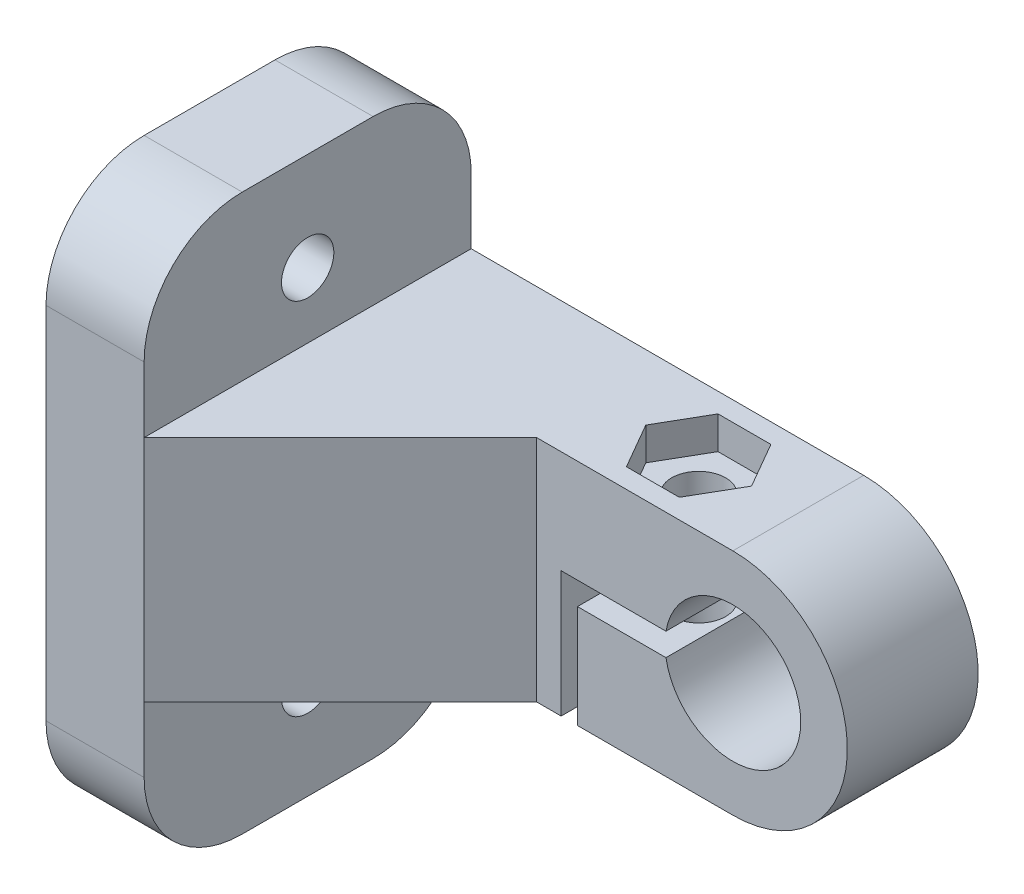
ISO-10303-21;
HEADER;
FILE_DESCRIPTION(('STEP AP214'),'2;1');
FILE_NAME('part.step','',(''),(''),'','','');
FILE_SCHEMA(('AUTOMOTIVE_DESIGN { 1 0 10303 214 1 1 1 1 }'));
ENDSEC;
DATA;
#1=APPLICATION_CONTEXT('core data for automotive mechanical design processes');
#2=APPLICATION_PROTOCOL_DEFINITION('international standard','automotive_design',2000,#1);
#3=PRODUCT_CONTEXT('',#1,'mechanical');
#4=PRODUCT('Part','Part','',(#3));
#5=PRODUCT_RELATED_PRODUCT_CATEGORY('part','',(#4));
#6=PRODUCT_DEFINITION_FORMATION('','',#4);
#7=PRODUCT_DEFINITION_CONTEXT('part definition',#1,'design');
#8=PRODUCT_DEFINITION('design','',#6,#7);
#9=PRODUCT_DEFINITION_SHAPE('','',#8);
#10=(LENGTH_UNIT() NAMED_UNIT(*) SI_UNIT(.MILLI.,.METRE.));
#11=(NAMED_UNIT(*) PLANE_ANGLE_UNIT() SI_UNIT($,.RADIAN.));
#12=(NAMED_UNIT(*) SI_UNIT($,.STERADIAN.) SOLID_ANGLE_UNIT());
#13=UNCERTAINTY_MEASURE_WITH_UNIT(LENGTH_MEASURE(1.E-05),#10,'distance_accuracy_value','');
#14=(GEOMETRIC_REPRESENTATION_CONTEXT(3) GLOBAL_UNCERTAINTY_ASSIGNED_CONTEXT((#13)) GLOBAL_UNIT_ASSIGNED_CONTEXT((#10,
#11,#12)) REPRESENTATION_CONTEXT('',''));
#15=CARTESIAN_POINT('',(0.,0.,0.));
#16=DIRECTION('',(0.,0.,1.));
#17=DIRECTION('',(1.,0.,0.));
#18=AXIS2_PLACEMENT_3D('',#15,#16,#17);
#19=CARTESIAN_POINT('',(-6.09053786194432,17.,4.));
#20=DIRECTION('',(0.,-1.,0.));
#21=DIRECTION('',(1.,0.,0.));
#22=AXIS2_PLACEMENT_3D('',#19,#20,#21);
#23=CYLINDRICAL_SURFACE('',#22,1.65);
#24=CARTESIAN_POINT('',(-6.09053786194432,0.699999999999999,4.));
#25=DIRECTION('',(0.,1.,0.));
#26=DIRECTION('',(-1.,0.,0.));
#27=AXIS2_PLACEMENT_3D('',#24,#25,#26);
#28=CIRCLE('',#27,1.65);
#29=CARTESIAN_POINT('',(-7.74053786194432,0.699999999999999,4.));
#30=VERTEX_POINT('',#29);
#31=EDGE_CURVE('E264',#30,#30,#28,.T.);
#32=ORIENTED_EDGE('',*,*,#31,.F.);
#33=EDGE_LOOP('',(#32));
#34=FACE_BOUND('',#33,.T.);
#35=CARTESIAN_POINT('',(-6.09053786194432,5.,4.));
#36=DIRECTION('',(0.,1.,0.));
#37=DIRECTION('',(-1.,0.,0.));
#38=AXIS2_PLACEMENT_3D('',#35,#36,#37);
#39=CIRCLE('',#38,1.65);
#40=CARTESIAN_POINT('',(-7.74053786194432,5.,4.));
#41=VERTEX_POINT('',#40);
#42=EDGE_CURVE('E39',#41,#41,#39,.F.);
#43=ORIENTED_EDGE('',*,*,#42,.F.);
#44=EDGE_LOOP('',(#43));
#45=FACE_BOUND('',#44,.T.);
#46=ADVANCED_FACE('F35',(#34,#45),#23,.F.);
#47=CARTESIAN_POINT('',(-12.,-11.,10.));
#48=DIRECTION('',(-1.,0.,0.));
#49=DIRECTION('',(0.,-1.,0.));
#50=AXIS2_PLACEMENT_3D('',#47,#48,#49);
#51=CYLINDRICAL_SURFACE('',#50,1.6);
#52=CARTESIAN_POINT('',(-24.,-11.,10.));
#53=DIRECTION('',(-1.,0.,0.));
#54=DIRECTION('',(0.,-1.,0.));
#55=AXIS2_PLACEMENT_3D('',#52,#53,#54);
#56=CIRCLE('',#55,1.6);
#57=CARTESIAN_POINT('',(-24.,-12.6,10.));
#58=VERTEX_POINT('',#57);
#59=EDGE_CURVE('E321',#58,#58,#56,.T.);
#60=ORIENTED_EDGE('',*,*,#59,.F.);
#61=EDGE_LOOP('',(#60));
#62=FACE_BOUND('',#61,.T.);
#63=CARTESIAN_POINT('',(-29.,-11.,10.));
#64=DIRECTION('',(-1.,0.,0.));
#65=DIRECTION('',(0.,-1.,0.));
#66=AXIS2_PLACEMENT_3D('',#63,#64,#65);
#67=CIRCLE('',#66,1.6);
#68=CARTESIAN_POINT('',(-29.,-12.6,10.));
#69=VERTEX_POINT('',#68);
#70=EDGE_CURVE('E307',#69,#69,#67,.F.);
#71=ORIENTED_EDGE('',*,*,#70,.F.);
#72=EDGE_LOOP('',(#71));
#73=FACE_BOUND('',#72,.T.);
#74=ADVANCED_FACE('F509',(#62,#73),#51,.F.);
#75=CARTESIAN_POINT('',(-12.,11.,10.));
#76=DIRECTION('',(-1.,0.,0.));
#77=DIRECTION('',(0.,-1.,0.));
#78=AXIS2_PLACEMENT_3D('',#75,#76,#77);
#79=CYLINDRICAL_SURFACE('',#78,1.6);
#80=CARTESIAN_POINT('',(-24.,11.,10.));
#81=DIRECTION('',(-1.,0.,0.));
#82=DIRECTION('',(0.,0.,1.));
#83=AXIS2_PLACEMENT_3D('',#80,#81,#82);
#84=CIRCLE('',#83,1.6);
#85=CARTESIAN_POINT('',(-24.,11.,11.6));
#86=VERTEX_POINT('',#85);
#87=EDGE_CURVE('E317',#86,#86,#84,.T.);
#88=ORIENTED_EDGE('',*,*,#87,.F.);
#89=EDGE_LOOP('',(#88));
#90=FACE_BOUND('',#89,.T.);
#91=CARTESIAN_POINT('',(-29.,11.,10.));
#92=DIRECTION('',(-1.,0.,0.));
#93=DIRECTION('',(0.,-1.,0.));
#94=AXIS2_PLACEMENT_3D('',#91,#92,#93);
#95=CIRCLE('',#94,1.6);
#96=CARTESIAN_POINT('',(-29.,9.39999999999999,10.));
#97=VERTEX_POINT('',#96);
#98=EDGE_CURVE('E313',#97,#97,#95,.F.);
#99=ORIENTED_EDGE('',*,*,#98,.F.);
#100=EDGE_LOOP('',(#99));
#101=FACE_BOUND('',#100,.T.);
#102=ADVANCED_FACE('F516',(#90,#101),#79,.F.);
#103=CARTESIAN_POINT('',(-24.,7.,20.));
#104=DIRECTION('',(-1.,0.,0.));
#105=DIRECTION('',(0.,0.,1.));
#106=AXIS2_PLACEMENT_3D('',#103,#104,#105);
#107=PLANE('',#106);
#108=ORIENTED_EDGE('',*,*,#87,.T.);
#109=EDGE_LOOP('',(#108));
#110=FACE_BOUND('',#109,.T.);
#111=DIRECTION('',(0.,0.,-1.));
#112=VECTOR('',#111,1.);
#113=CARTESIAN_POINT('',(-24.,17.,20.));
#114=LINE('',#113,#112);
#115=CARTESIAN_POINT('',(-24.,17.,14.));
#116=VERTEX_POINT('',#115);
#117=CARTESIAN_POINT('',(-24.,17.,6.));
#118=VERTEX_POINT('',#117);
#119=EDGE_CURVE('E394',#116,#118,#114,.T.);
#120=ORIENTED_EDGE('',*,*,#119,.F.);
#121=CARTESIAN_POINT('',(-24.,11.,14.));
#122=DIRECTION('',(-1.,0.,0.));
#123=DIRECTION('',(0.,0.,1.));
#124=AXIS2_PLACEMENT_3D('',#121,#122,#123);
#125=CIRCLE('',#124,6.);
#126=CARTESIAN_POINT('',(-24.,11.,20.));
#127=VERTEX_POINT('',#126);
#128=EDGE_CURVE('E11',#116,#127,#125,.F.);
#129=ORIENTED_EDGE('',*,*,#128,.T.);
#130=DIRECTION('',(0.,1.,0.));
#131=VECTOR('',#130,1.);
#132=CARTESIAN_POINT('',(-24.,7.,20.));
#133=LINE('',#132,#131);
#134=CARTESIAN_POINT('',(-24.,7.,20.));
#135=VERTEX_POINT('',#134);
#136=EDGE_CURVE('E322',#135,#127,#133,.T.);
#137=ORIENTED_EDGE('',*,*,#136,.F.);
#138=DIRECTION('',(0.,0.,-1.));
#139=VECTOR('',#138,1.);
#140=CARTESIAN_POINT('',(-24.,7.,20.));
#141=LINE('',#140,#139);
#142=CARTESIAN_POINT('',(-24.,7.,0.));
#143=VERTEX_POINT('',#142);
#144=EDGE_CURVE('E332',#135,#143,#141,.T.);
#145=ORIENTED_EDGE('',*,*,#144,.T.);
#146=DIRECTION('',(0.,1.,0.));
#147=VECTOR('',#146,1.);
#148=CARTESIAN_POINT('',(-24.,7.,0.));
#149=LINE('',#148,#147);
#150=CARTESIAN_POINT('',(-24.,11.,0.));
#151=VERTEX_POINT('',#150);
#152=EDGE_CURVE('E320',#143,#151,#149,.T.);
#153=ORIENTED_EDGE('',*,*,#152,.T.);
#154=CARTESIAN_POINT('',(-24.,11.,6.));
#155=DIRECTION('',(-1.,0.,0.));
#156=DIRECTION('',(0.,0.,1.));
#157=AXIS2_PLACEMENT_3D('',#154,#155,#156);
#158=CIRCLE('',#157,6.);
#159=EDGE_CURVE('E44',#151,#118,#158,.F.);
#160=ORIENTED_EDGE('',*,*,#159,.T.);
#161=EDGE_LOOP('',(#120,#129,#137,#145,#153,#160));
#162=FACE_BOUND('',#161,.T.);
#163=ADVANCED_FACE('F441',(#110,#162),#107,.F.);
#164=CARTESIAN_POINT('',(-24.,17.,20.));
#165=DIRECTION('',(0.,-1.,0.));
#166=DIRECTION('',(0.,0.,-1.));
#167=AXIS2_PLACEMENT_3D('',#164,#165,#166);
#168=PLANE('',#167);
#169=DIRECTION('',(0.,0.,-1.));
#170=VECTOR('',#169,1.);
#171=CARTESIAN_POINT('',(-30.,17.,20.));
#172=LINE('',#171,#170);
#173=CARTESIAN_POINT('',(-30.,17.,14.));
#174=VERTEX_POINT('',#173);
#175=CARTESIAN_POINT('',(-30.,17.,6.));
#176=VERTEX_POINT('',#175);
#177=EDGE_CURVE('E391',#174,#176,#172,.T.);
#178=ORIENTED_EDGE('',*,*,#177,.F.);
#179=DIRECTION('',(-1.,0.,0.));
#180=VECTOR('',#179,1.);
#181=CARTESIAN_POINT('',(-24.,17.,14.));
#182=LINE('',#181,#180);
#183=EDGE_CURVE('E432',#174,#116,#182,.F.);
#184=ORIENTED_EDGE('',*,*,#183,.T.);
#185=ORIENTED_EDGE('',*,*,#119,.T.);
#186=DIRECTION('',(-1.,0.,0.));
#187=VECTOR('',#186,1.);
#188=CARTESIAN_POINT('',(-24.,17.,6.));
#189=LINE('',#188,#187);
#190=EDGE_CURVE('E429',#118,#176,#189,.T.);
#191=ORIENTED_EDGE('',*,*,#190,.T.);
#192=EDGE_LOOP('',(#178,#184,#185,#191));
#193=FACE_BOUND('',#192,.T.);
#194=ADVANCED_FACE('F437',(#193),#168,.F.);
#195=CARTESIAN_POINT('',(-30.,17.,20.));
#196=DIRECTION('',(1.,0.,0.));
#197=DIRECTION('',(0.,1.,0.));
#198=AXIS2_PLACEMENT_3D('',#195,#196,#197);
#199=PLANE('',#198);
#200=CARTESIAN_POINT('',(-30.,-11.,10.));
#201=DIRECTION('',(-1.,0.,0.));
#202=DIRECTION('',(0.,-1.,0.));
#203=AXIS2_PLACEMENT_3D('',#200,#201,#202);
#204=CIRCLE('',#203,5.25);
#205=CARTESIAN_POINT('',(-30.,-16.25,10.));
#206=VERTEX_POINT('',#205);
#207=EDGE_CURVE('E303',#206,#206,#204,.T.);
#208=ORIENTED_EDGE('',*,*,#207,.F.);
#209=EDGE_LOOP('',(#208));
#210=FACE_BOUND('',#209,.T.);
#211=CARTESIAN_POINT('',(-30.,11.,10.));
#212=DIRECTION('',(-1.,0.,0.));
#213=DIRECTION('',(0.,-1.,0.));
#214=AXIS2_PLACEMENT_3D('',#211,#212,#213);
#215=CIRCLE('',#214,5.25);
#216=CARTESIAN_POINT('',(-30.,5.74999999999999,10.));
#217=VERTEX_POINT('',#216);
#218=EDGE_CURVE('E314',#217,#217,#215,.T.);
#219=ORIENTED_EDGE('',*,*,#218,.F.);
#220=EDGE_LOOP('',(#219));
#221=FACE_BOUND('',#220,.T.);
#222=DIRECTION('',(0.,0.,-1.));
#223=VECTOR('',#222,1.);
#224=CARTESIAN_POINT('',(-30.,-17.,20.));
#225=LINE('',#224,#223);
#226=CARTESIAN_POINT('',(-30.,-17.,14.));
#227=VERTEX_POINT('',#226);
#228=CARTESIAN_POINT('',(-30.,-17.,6.));
#229=VERTEX_POINT('',#228);
#230=EDGE_CURVE('E388',#227,#229,#225,.T.);
#231=ORIENTED_EDGE('',*,*,#230,.F.);
#232=CARTESIAN_POINT('',(-30.,-11.,14.));
#233=DIRECTION('',(1.,0.,0.));
#234=DIRECTION('',(0.,1.,0.));
#235=AXIS2_PLACEMENT_3D('',#232,#233,#234);
#236=CIRCLE('',#235,6.);
#237=CARTESIAN_POINT('',(-30.,-11.,20.));
#238=VERTEX_POINT('',#237);
#239=EDGE_CURVE('E423',#227,#238,#236,.F.);
#240=ORIENTED_EDGE('',*,*,#239,.T.);
#241=DIRECTION('',(0.,-1.,0.));
#242=VECTOR('',#241,1.);
#243=CARTESIAN_POINT('',(-30.,17.,20.));
#244=LINE('',#243,#242);
#245=CARTESIAN_POINT('',(-30.,11.,20.));
#246=VERTEX_POINT('',#245);
#247=EDGE_CURVE('E325',#246,#238,#244,.T.);
#248=ORIENTED_EDGE('',*,*,#247,.F.);
#249=CARTESIAN_POINT('',(-30.,11.,14.));
#250=DIRECTION('',(1.,0.,0.));
#251=DIRECTION('',(0.,1.,0.));
#252=AXIS2_PLACEMENT_3D('',#249,#250,#251);
#253=CIRCLE('',#252,6.);
#254=EDGE_CURVE('E419',#246,#174,#253,.F.);
#255=ORIENTED_EDGE('',*,*,#254,.T.);
#256=ORIENTED_EDGE('',*,*,#177,.T.);
#257=CARTESIAN_POINT('',(-30.,11.,6.));
#258=DIRECTION('',(1.,0.,0.));
#259=DIRECTION('',(0.,1.,0.));
#260=AXIS2_PLACEMENT_3D('',#257,#258,#259);
#261=CIRCLE('',#260,6.);
#262=CARTESIAN_POINT('',(-30.,11.,0.));
#263=VERTEX_POINT('',#262);
#264=EDGE_CURVE('E417',#176,#263,#261,.F.);
#265=ORIENTED_EDGE('',*,*,#264,.T.);
#266=DIRECTION('',(0.,-1.,0.));
#267=VECTOR('',#266,1.);
#268=CARTESIAN_POINT('',(-30.,17.,0.));
#269=LINE('',#268,#267);
#270=CARTESIAN_POINT('',(-30.,-11.,0.));
#271=VERTEX_POINT('',#270);
#272=EDGE_CURVE('E334',#263,#271,#269,.T.);
#273=ORIENTED_EDGE('',*,*,#272,.T.);
#274=CARTESIAN_POINT('',(-30.,-11.,6.));
#275=DIRECTION('',(1.,0.,0.));
#276=DIRECTION('',(0.,1.,0.));
#277=AXIS2_PLACEMENT_3D('',#274,#275,#276);
#278=CIRCLE('',#277,6.);
#279=EDGE_CURVE('E421',#271,#229,#278,.F.);
#280=ORIENTED_EDGE('',*,*,#279,.T.);
#281=EDGE_LOOP('',(#231,#240,#248,#255,#256,#265,#273,#280));
#282=FACE_BOUND('',#281,.T.);
#283=ADVANCED_FACE('F451',(#210,#221,#282),#199,.F.);
#284=CARTESIAN_POINT('',(-24.,-17.,20.));
#285=DIRECTION('',(0.,1.,0.));
#286=DIRECTION('',(0.,0.,1.));
#287=AXIS2_PLACEMENT_3D('',#284,#285,#286);
#288=PLANE('',#287);
#289=DIRECTION('',(0.,0.,-1.));
#290=VECTOR('',#289,1.);
#291=CARTESIAN_POINT('',(-24.,-17.,20.));
#292=LINE('',#291,#290);
#293=CARTESIAN_POINT('',(-24.,-17.,14.));
#294=VERTEX_POINT('',#293);
#295=CARTESIAN_POINT('',(-24.,-17.,6.));
#296=VERTEX_POINT('',#295);
#297=EDGE_CURVE('E385',#294,#296,#292,.T.);
#298=ORIENTED_EDGE('',*,*,#297,.F.);
#299=DIRECTION('',(1.,0.,0.));
#300=VECTOR('',#299,1.);
#301=CARTESIAN_POINT('',(-30.,-17.,14.));
#302=LINE('',#301,#300);
#303=EDGE_CURVE('E415',#294,#227,#302,.F.);
#304=ORIENTED_EDGE('',*,*,#303,.T.);
#305=ORIENTED_EDGE('',*,*,#230,.T.);
#306=DIRECTION('',(1.,0.,0.));
#307=VECTOR('',#306,1.);
#308=CARTESIAN_POINT('',(-24.,-17.,6.));
#309=LINE('',#308,#307);
#310=EDGE_CURVE('E412',#229,#296,#309,.T.);
#311=ORIENTED_EDGE('',*,*,#310,.T.);
#312=EDGE_LOOP('',(#298,#304,#305,#311));
#313=FACE_BOUND('',#312,.T.);
#314=ADVANCED_FACE('F497',(#313),#288,.F.);
#315=CARTESIAN_POINT('',(-24.,-7.,20.));
#316=DIRECTION('',(-1.,0.,0.));
#317=DIRECTION('',(0.,-1.,0.));
#318=AXIS2_PLACEMENT_3D('',#315,#316,#317);
#319=PLANE('',#318);
#320=ORIENTED_EDGE('',*,*,#59,.T.);
#321=EDGE_LOOP('',(#320));
#322=FACE_BOUND('',#321,.T.);
#323=DIRECTION('',(0.,1.,0.));
#324=VECTOR('',#323,1.);
#325=CARTESIAN_POINT('',(-24.,-7.,20.));
#326=LINE('',#325,#324);
#327=CARTESIAN_POINT('',(-24.,-11.,20.));
#328=VERTEX_POINT('',#327);
#329=CARTESIAN_POINT('',(-24.,-7.,20.));
#330=VERTEX_POINT('',#329);
#331=EDGE_CURVE('E329',#328,#330,#326,.T.);
#332=ORIENTED_EDGE('',*,*,#331,.F.);
#333=CARTESIAN_POINT('',(-24.,-11.,14.));
#334=DIRECTION('',(-1.,0.,0.));
#335=DIRECTION('',(0.,-1.,0.));
#336=AXIS2_PLACEMENT_3D('',#333,#334,#335);
#337=CIRCLE('',#336,6.);
#338=EDGE_CURVE('E410',#328,#294,#337,.F.);
#339=ORIENTED_EDGE('',*,*,#338,.T.);
#340=ORIENTED_EDGE('',*,*,#297,.T.);
#341=CARTESIAN_POINT('',(-24.,-11.,6.));
#342=DIRECTION('',(-1.,0.,0.));
#343=DIRECTION('',(0.,-1.,0.));
#344=AXIS2_PLACEMENT_3D('',#341,#342,#343);
#345=CIRCLE('',#344,6.);
#346=CARTESIAN_POINT('',(-24.,-11.,0.));
#347=VERTEX_POINT('',#346);
#348=EDGE_CURVE('E408',#296,#347,#345,.F.);
#349=ORIENTED_EDGE('',*,*,#348,.T.);
#350=DIRECTION('',(0.,1.,0.));
#351=VECTOR('',#350,1.);
#352=CARTESIAN_POINT('',(-24.,-7.,0.));
#353=LINE('',#352,#351);
#354=CARTESIAN_POINT('',(-24.,-7.,0.));
#355=VERTEX_POINT('',#354);
#356=EDGE_CURVE('E337',#347,#355,#353,.T.);
#357=ORIENTED_EDGE('',*,*,#356,.T.);
#358=DIRECTION('',(0.,0.,-1.));
#359=VECTOR('',#358,1.);
#360=CARTESIAN_POINT('',(-24.,-7.,20.));
#361=LINE('',#360,#359);
#362=EDGE_CURVE('E382',#330,#355,#361,.T.);
#363=ORIENTED_EDGE('',*,*,#362,.F.);
#364=EDGE_LOOP('',(#332,#339,#340,#349,#357,#363));
#365=FACE_BOUND('',#364,.T.);
#366=ADVANCED_FACE('F459',(#322,#365),#319,.F.);
#367=CARTESIAN_POINT('',(-24.,-7.,20.));
#368=DIRECTION('',(0.,1.,0.));
#369=DIRECTION('',(-1.,0.,0.));
#370=AXIS2_PLACEMENT_3D('',#367,#368,#369);
#371=PLANE('',#370);
#372=DIRECTION('',(-1.,0.,0.));
#373=VECTOR('',#372,1.);
#374=CARTESIAN_POINT('',(-24.,-7.,8.));
#375=LINE('',#374,#373);
#376=CARTESIAN_POINT('',(-10.5,-7.,8.));
#377=VERTEX_POINT('',#376);
#378=CARTESIAN_POINT('',(-11.9999999999999,-7.,8.));
#379=VERTEX_POINT('',#378);
#380=EDGE_CURVE('E300',#377,#379,#375,.T.);
#381=ORIENTED_EDGE('',*,*,#380,.T.);
#382=DIRECTION('',(-0.707106781186551,0.,0.707106781186544));
#383=VECTOR('',#382,1.);
#384=CARTESIAN_POINT('',(-24.,-7.,20.));
#385=LINE('',#384,#383);
#386=EDGE_CURVE('E275',#379,#330,#385,.T.);
#387=ORIENTED_EDGE('',*,*,#386,.T.);
#388=ORIENTED_EDGE('',*,*,#362,.T.);
#389=DIRECTION('',(1.,0.,0.));
#390=VECTOR('',#389,1.);
#391=CARTESIAN_POINT('',(-24.,-7.,0.));
#392=LINE('',#391,#390);
#393=CARTESIAN_POINT('',(-10.5,-7.,0.));
#394=VERTEX_POINT('',#393);
#395=EDGE_CURVE('E339',#355,#394,#392,.T.);
#396=ORIENTED_EDGE('',*,*,#395,.T.);
#397=DIRECTION('',(0.,0.,-1.));
#398=VECTOR('',#397,1.);
#399=CARTESIAN_POINT('',(-10.5,-7.,20.));
#400=LINE('',#399,#398);
#401=EDGE_CURVE('E380',#377,#394,#400,.T.);
#402=ORIENTED_EDGE('',*,*,#401,.F.);
#403=EDGE_LOOP('',(#381,#387,#388,#396,#402));
#404=FACE_BOUND('',#403,.T.);
#405=ADVANCED_FACE('F464',(#404),#371,.F.);
#406=CARTESIAN_POINT('',(-10.5,0.699999999999999,20.));
#407=DIRECTION('',(-1.,0.,0.));
#408=DIRECTION('',(0.,-1.,0.));
#409=AXIS2_PLACEMENT_3D('',#406,#407,#408);
#410=PLANE('',#409);
#411=DIRECTION('',(0.,0.,-1.));
#412=VECTOR('',#411,1.);
#413=CARTESIAN_POINT('',(-10.5,0.699999999999999,20.));
#414=LINE('',#413,#412);
#415=CARTESIAN_POINT('',(-10.5,0.699999999999999,8.));
#416=VERTEX_POINT('',#415);
#417=CARTESIAN_POINT('',(-10.5,0.699999999999999,0.));
#418=VERTEX_POINT('',#417);
#419=EDGE_CURVE('E378',#416,#418,#414,.T.);
#420=ORIENTED_EDGE('',*,*,#419,.F.);
#421=DIRECTION('',(0.,-1.,0.));
#422=VECTOR('',#421,1.);
#423=CARTESIAN_POINT('',(-10.5,0.699999999999999,8.));
#424=LINE('',#423,#422);
#425=EDGE_CURVE('E297',#416,#377,#424,.T.);
#426=ORIENTED_EDGE('',*,*,#425,.T.);
#427=ORIENTED_EDGE('',*,*,#401,.T.);
#428=DIRECTION('',(0.,1.,0.));
#429=VECTOR('',#428,1.);
#430=CARTESIAN_POINT('',(-10.5,0.699999999999999,0.));
#431=LINE('',#430,#429);
#432=EDGE_CURVE('E342',#394,#418,#431,.T.);
#433=ORIENTED_EDGE('',*,*,#432,.T.);
#434=EDGE_LOOP('',(#420,#426,#427,#433));
#435=FACE_BOUND('',#434,.T.);
#436=ADVANCED_FACE('F474',(#435),#410,.F.);
#437=CARTESIAN_POINT('',(-4.09053786194432,0.7,20.));
#438=DIRECTION('',(0.,1.,0.));
#439=DIRECTION('',(-1.,0.,0.));
#440=AXIS2_PLACEMENT_3D('',#437,#438,#439);
#441=PLANE('',#440);
#442=ORIENTED_EDGE('',*,*,#31,.T.);
#443=EDGE_LOOP('',(#442));
#444=FACE_BOUND('',#443,.T.);
#445=DIRECTION('',(0.,0.,-1.));
#446=VECTOR('',#445,1.);
#447=CARTESIAN_POINT('',(-4.09053786194432,0.699999999999999,20.));
#448=LINE('',#447,#446);
#449=CARTESIAN_POINT('',(-4.09053786194432,0.699999999999999,8.));
#450=VERTEX_POINT('',#449);
#451=CARTESIAN_POINT('',(-4.09053786194432,0.699999999999999,0.));
#452=VERTEX_POINT('',#451);
#453=EDGE_CURVE('E376',#450,#452,#448,.T.);
#454=ORIENTED_EDGE('',*,*,#453,.F.);
#455=DIRECTION('',(-1.,0.,0.));
#456=VECTOR('',#455,1.);
#457=CARTESIAN_POINT('',(-4.09053786194432,0.7,8.));
#458=LINE('',#457,#456);
#459=EDGE_CURVE('E294',#450,#416,#458,.T.);
#460=ORIENTED_EDGE('',*,*,#459,.T.);
#461=ORIENTED_EDGE('',*,*,#419,.T.);
#462=DIRECTION('',(1.,0.,0.));
#463=VECTOR('',#462,1.);
#464=CARTESIAN_POINT('',(-4.09053786194432,0.7,0.));
#465=LINE('',#464,#463);
#466=EDGE_CURVE('E345',#418,#452,#465,.T.);
#467=ORIENTED_EDGE('',*,*,#466,.T.);
#468=EDGE_LOOP('',(#454,#460,#461,#467));
#469=FACE_BOUND('',#468,.T.);
#470=ADVANCED_FACE('F556',(#444,#469),#441,.F.);
#471=CARTESIAN_POINT('',(0.,0.,20.));
#472=DIRECTION('',(0.,0.,-1.));
#473=DIRECTION('',(-1.,0.,0.));
#474=AXIS2_PLACEMENT_3D('',#471,#472,#473);
#475=CYLINDRICAL_SURFACE('',#474,4.15);
#476=DIRECTION('',(0.,0.,-1.));
#477=VECTOR('',#476,1.);
#478=CARTESIAN_POINT('',(-4.09053786194432,-0.7,20.));
#479=LINE('',#478,#477);
#480=CARTESIAN_POINT('',(-4.09053786194432,-0.7,8.));
#481=VERTEX_POINT('',#480);
#482=CARTESIAN_POINT('',(-4.09053786194432,-0.7,0.));
#483=VERTEX_POINT('',#482);
#484=EDGE_CURVE('E374',#481,#483,#479,.T.);
#485=ORIENTED_EDGE('',*,*,#484,.F.);
#486=CARTESIAN_POINT('',(0.,0.,8.));
#487=DIRECTION('',(0.,0.,-1.));
#488=DIRECTION('',(-1.,0.,0.));
#489=AXIS2_PLACEMENT_3D('',#486,#487,#488);
#490=CIRCLE('',#489,4.15);
#491=EDGE_CURVE('E291',#481,#450,#490,.F.);
#492=ORIENTED_EDGE('',*,*,#491,.T.);
#493=ORIENTED_EDGE('',*,*,#453,.T.);
#494=CARTESIAN_POINT('',(0.,0.,0.));
#495=DIRECTION('',(0.,0.,-1.));
#496=DIRECTION('',(1.,0.,0.));
#497=AXIS2_PLACEMENT_3D('',#494,#495,#496);
#498=CIRCLE('',#497,4.15);
#499=EDGE_CURVE('E348',#452,#483,#498,.T.);
#500=ORIENTED_EDGE('',*,*,#499,.T.);
#501=EDGE_LOOP('',(#485,#492,#493,#500));
#502=FACE_BOUND('',#501,.T.);
#503=ADVANCED_FACE('F538',(#502),#475,.F.);
#504=CARTESIAN_POINT('',(-4.09053786194432,-0.7,20.));
#505=DIRECTION('',(0.,-1.,0.));
#506=DIRECTION('',(1.,0.,0.));
#507=AXIS2_PLACEMENT_3D('',#504,#505,#506);
#508=PLANE('',#507);
#509=CARTESIAN_POINT('',(-6.09053786194432,-0.699999999999999,4.));
#510=DIRECTION('',(0.,-1.,0.));
#511=DIRECTION('',(1.,0.,0.));
#512=AXIS2_PLACEMENT_3D('',#509,#510,#511);
#513=CIRCLE('',#512,1.65);
#514=CARTESIAN_POINT('',(-4.44053786194432,-0.699999999999999,4.));
#515=VERTEX_POINT('',#514);
#516=EDGE_CURVE('E261',#515,#515,#513,.T.);
#517=ORIENTED_EDGE('',*,*,#516,.T.);
#518=EDGE_LOOP('',(#517));
#519=FACE_BOUND('',#518,.T.);
#520=DIRECTION('',(0.,0.,-1.));
#521=VECTOR('',#520,1.);
#522=CARTESIAN_POINT('',(-9.5,-0.700000000000001,20.));
#523=LINE('',#522,#521);
#524=CARTESIAN_POINT('',(-9.5,-0.700000000000001,8.));
#525=VERTEX_POINT('',#524);
#526=CARTESIAN_POINT('',(-9.5,-0.700000000000001,0.));
#527=VERTEX_POINT('',#526);
#528=EDGE_CURVE('E372',#525,#527,#523,.T.);
#529=ORIENTED_EDGE('',*,*,#528,.F.);
#530=DIRECTION('',(1.,0.,0.));
#531=VECTOR('',#530,1.);
#532=CARTESIAN_POINT('',(-4.09053786194432,-0.7,8.));
#533=LINE('',#532,#531);
#534=EDGE_CURVE('E288',#525,#481,#533,.T.);
#535=ORIENTED_EDGE('',*,*,#534,.T.);
#536=ORIENTED_EDGE('',*,*,#484,.T.);
#537=DIRECTION('',(-1.,0.,0.));
#538=VECTOR('',#537,1.);
#539=CARTESIAN_POINT('',(-4.09053786194432,-0.7,0.));
#540=LINE('',#539,#538);
#541=EDGE_CURVE('E351',#483,#527,#540,.T.);
#542=ORIENTED_EDGE('',*,*,#541,.T.);
#543=EDGE_LOOP('',(#529,#535,#536,#542));
#544=FACE_BOUND('',#543,.T.);
#545=ADVANCED_FACE('F534',(#519,#544),#508,.F.);
#546=CARTESIAN_POINT('',(-9.5,-0.700000000000001,20.));
#547=DIRECTION('',(1.,0.,0.));
#548=DIRECTION('',(0.,0.,-1.));
#549=AXIS2_PLACEMENT_3D('',#546,#547,#548);
#550=PLANE('',#549);
#551=DIRECTION('',(0.,0.,-1.));
#552=VECTOR('',#551,1.);
#553=CARTESIAN_POINT('',(-9.5,-7.,20.));
#554=LINE('',#553,#552);
#555=CARTESIAN_POINT('',(-9.5,-7.,8.));
#556=VERTEX_POINT('',#555);
#557=CARTESIAN_POINT('',(-9.5,-7.,0.));
#558=VERTEX_POINT('',#557);
#559=EDGE_CURVE('E370',#556,#558,#554,.T.);
#560=ORIENTED_EDGE('',*,*,#559,.F.);
#561=DIRECTION('',(0.,1.,0.));
#562=VECTOR('',#561,1.);
#563=CARTESIAN_POINT('',(-9.5,-0.700000000000001,8.));
#564=LINE('',#563,#562);
#565=EDGE_CURVE('E285',#556,#525,#564,.T.);
#566=ORIENTED_EDGE('',*,*,#565,.T.);
#567=ORIENTED_EDGE('',*,*,#528,.T.);
#568=DIRECTION('',(0.,-1.,0.));
#569=VECTOR('',#568,1.);
#570=CARTESIAN_POINT('',(-9.5,-0.700000000000001,0.));
#571=LINE('',#570,#569);
#572=EDGE_CURVE('E354',#527,#558,#571,.T.);
#573=ORIENTED_EDGE('',*,*,#572,.T.);
#574=EDGE_LOOP('',(#560,#566,#567,#573));
#575=FACE_BOUND('',#574,.T.);
#576=ADVANCED_FACE('F537',(#575),#550,.F.);
#577=CARTESIAN_POINT('',(-9.5,-7.,20.));
#578=DIRECTION('',(0.,1.,0.));
#579=DIRECTION('',(0.,0.,1.));
#580=AXIS2_PLACEMENT_3D('',#577,#578,#579);
#581=PLANE('',#580);
#582=CARTESIAN_POINT('',(-6.09053786194432,-7.,4.));
#583=DIRECTION('',(0.,1.,0.));
#584=DIRECTION('',(0.,0.,1.));
#585=AXIS2_PLACEMENT_3D('',#582,#583,#584);
#586=CIRCLE('',#585,1.65);
#587=CARTESIAN_POINT('',(-6.09053786194432,-7.,5.65));
#588=VERTEX_POINT('',#587);
#589=EDGE_CURVE('E258',#588,#588,#586,.T.);
#590=ORIENTED_EDGE('',*,*,#589,.T.);
#591=EDGE_LOOP('',(#590));
#592=FACE_BOUND('',#591,.T.);
#593=DIRECTION('',(0.,0.,-1.));
#594=VECTOR('',#593,1.);
#595=CARTESIAN_POINT('',(0.,-7.,20.));
#596=LINE('',#595,#594);
#597=CARTESIAN_POINT('',(0.,-7.,8.));
#598=VERTEX_POINT('',#597);
#599=CARTESIAN_POINT('',(0.,-7.,0.));
#600=VERTEX_POINT('',#599);
#601=EDGE_CURVE('E368',#598,#600,#596,.T.);
#602=ORIENTED_EDGE('',*,*,#601,.F.);
#603=DIRECTION('',(-1.,0.,0.));
#604=VECTOR('',#603,1.);
#605=CARTESIAN_POINT('',(-9.5,-7.,8.));
#606=LINE('',#605,#604);
#607=EDGE_CURVE('E282',#598,#556,#606,.T.);
#608=ORIENTED_EDGE('',*,*,#607,.T.);
#609=ORIENTED_EDGE('',*,*,#559,.T.);
#610=DIRECTION('',(1.,0.,0.));
#611=VECTOR('',#610,1.);
#612=CARTESIAN_POINT('',(-9.5,-7.,0.));
#613=LINE('',#612,#611);
#614=EDGE_CURVE('E357',#558,#600,#613,.T.);
#615=ORIENTED_EDGE('',*,*,#614,.T.);
#616=EDGE_LOOP('',(#602,#608,#609,#615));
#617=FACE_BOUND('',#616,.T.);
#618=ADVANCED_FACE('F550',(#592,#617),#581,.F.);
#619=CARTESIAN_POINT('',(0.,0.,20.));
#620=DIRECTION('',(0.,0.,-1.));
#621=DIRECTION('',(-1.,0.,0.));
#622=AXIS2_PLACEMENT_3D('',#619,#620,#621);
#623=CYLINDRICAL_SURFACE('',#622,7.);
#624=DIRECTION('',(0.,0.,-1.));
#625=VECTOR('',#624,1.);
#626=CARTESIAN_POINT('',(0.,7.,20.));
#627=LINE('',#626,#625);
#628=CARTESIAN_POINT('',(0.,7.,8.));
#629=VERTEX_POINT('',#628);
#630=CARTESIAN_POINT('',(0.,7.,0.));
#631=VERTEX_POINT('',#630);
#632=EDGE_CURVE('E366',#629,#631,#627,.T.);
#633=ORIENTED_EDGE('',*,*,#632,.F.);
#634=CARTESIAN_POINT('',(0.,0.,8.));
#635=DIRECTION('',(0.,0.,-1.));
#636=DIRECTION('',(-1.,0.,0.));
#637=AXIS2_PLACEMENT_3D('',#634,#635,#636);
#638=CIRCLE('',#637,7.);
#639=EDGE_CURVE('E280',#629,#598,#638,.T.);
#640=ORIENTED_EDGE('',*,*,#639,.T.);
#641=ORIENTED_EDGE('',*,*,#601,.T.);
#642=CARTESIAN_POINT('',(0.,0.,0.));
#643=DIRECTION('',(0.,0.,1.));
#644=DIRECTION('',(1.,0.,0.));
#645=AXIS2_PLACEMENT_3D('',#642,#643,#644);
#646=CIRCLE('',#645,7.);
#647=EDGE_CURVE('E360',#600,#631,#646,.T.);
#648=ORIENTED_EDGE('',*,*,#647,.T.);
#649=EDGE_LOOP('',(#633,#640,#641,#648));
#650=FACE_BOUND('',#649,.T.);
#651=ADVANCED_FACE('F552',(#650),#623,.T.);
#652=CARTESIAN_POINT('',(0.,7.,20.));
#653=DIRECTION('',(0.,-1.,0.));
#654=DIRECTION('',(1.,0.,0.));
#655=AXIS2_PLACEMENT_3D('',#652,#653,#654);
#656=PLANE('',#655);
#657=DIRECTION('',(-0.500000000000001,0.,-0.866025403784438));
#658=VECTOR('',#657,1.);
#659=CARTESIAN_POINT('',(-2.85737635448241,7.,4.));
#660=LINE('',#659,#658);
#661=CARTESIAN_POINT('',(-2.85737635448242,7.,4.));
#662=VERTEX_POINT('',#661);
#663=CARTESIAN_POINT('',(-4.47395710821337,7.,1.2));
#664=VERTEX_POINT('',#663);
#665=EDGE_CURVE('E239',#662,#664,#660,.T.);
#666=ORIENTED_EDGE('',*,*,#665,.F.);
#667=DIRECTION('',(0.5,0.,-0.866025403784439));
#668=VECTOR('',#667,1.);
#669=CARTESIAN_POINT('',(-4.47395710821337,7.,6.8));
#670=LINE('',#669,#668);
#671=CARTESIAN_POINT('',(-4.47395710821337,7.,6.8));
#672=VERTEX_POINT('',#671);
#673=EDGE_CURVE('E51',#672,#662,#670,.T.);
#674=ORIENTED_EDGE('',*,*,#673,.F.);
#675=DIRECTION('',(1.,0.,0.));
#676=VECTOR('',#675,1.);
#677=CARTESIAN_POINT('',(-7.70711861567527,7.,6.8));
#678=LINE('',#677,#676);
#679=CARTESIAN_POINT('',(-7.70711861567527,7.,6.8));
#680=VERTEX_POINT('',#679);
#681=EDGE_CURVE('E225',#680,#672,#678,.T.);
#682=ORIENTED_EDGE('',*,*,#681,.F.);
#683=DIRECTION('',(0.5,0.,0.866025403784439));
#684=VECTOR('',#683,1.);
#685=CARTESIAN_POINT('',(-9.32369936940622,7.,4.));
#686=LINE('',#685,#684);
#687=CARTESIAN_POINT('',(-9.32369936940622,7.,4.));
#688=VERTEX_POINT('',#687);
#689=EDGE_CURVE('E228',#688,#680,#686,.T.);
#690=ORIENTED_EDGE('',*,*,#689,.F.);
#691=DIRECTION('',(-0.499999999999999,0.,0.866025403784439));
#692=VECTOR('',#691,1.);
#693=CARTESIAN_POINT('',(-7.70711861567527,7.,1.2));
#694=LINE('',#693,#692);
#695=CARTESIAN_POINT('',(-7.70711861567527,7.,1.2));
#696=VERTEX_POINT('',#695);
#697=EDGE_CURVE('E244',#696,#688,#694,.T.);
#698=ORIENTED_EDGE('',*,*,#697,.F.);
#699=DIRECTION('',(-1.,0.,0.));
#700=VECTOR('',#699,1.);
#701=CARTESIAN_POINT('',(-4.47395710821337,7.,1.2));
#702=LINE('',#701,#700);
#703=EDGE_CURVE('E241',#664,#696,#702,.T.);
#704=ORIENTED_EDGE('',*,*,#703,.F.);
#705=EDGE_LOOP('',(#666,#674,#682,#690,#698,#704));
#706=FACE_BOUND('',#705,.T.);
#707=ORIENTED_EDGE('',*,*,#144,.F.);
#708=DIRECTION('',(-0.707106781186551,0.,0.707106781186544));
#709=VECTOR('',#708,1.);
#710=CARTESIAN_POINT('',(-24.,7.,20.));
#711=LINE('',#710,#709);
#712=CARTESIAN_POINT('',(-11.9999999999999,7.,8.));
#713=VERTEX_POINT('',#712);
#714=EDGE_CURVE('E269',#713,#135,#711,.T.);
#715=ORIENTED_EDGE('',*,*,#714,.F.);
#716=DIRECTION('',(-1.,0.,0.));
#717=VECTOR('',#716,1.);
#718=CARTESIAN_POINT('',(-11.9999999999999,7.,8.));
#719=LINE('',#718,#717);
#720=EDGE_CURVE('E267',#629,#713,#719,.T.);
#721=ORIENTED_EDGE('',*,*,#720,.F.);
#722=ORIENTED_EDGE('',*,*,#632,.T.);
#723=DIRECTION('',(-1.,0.,0.));
#724=VECTOR('',#723,1.);
#725=CARTESIAN_POINT('',(0.,7.,0.));
#726=LINE('',#725,#724);
#727=EDGE_CURVE('E326',#631,#143,#726,.T.);
#728=ORIENTED_EDGE('',*,*,#727,.T.);
#729=EDGE_LOOP('',(#707,#715,#721,#722,#728));
#730=FACE_BOUND('',#729,.T.);
#731=ADVANCED_FACE('F484',(#706,#730),#656,.F.);
#732=CARTESIAN_POINT('',(0.,0.,20.));
#733=DIRECTION('',(0.,0.,1.));
#734=DIRECTION('',(1.,0.,0.));
#735=AXIS2_PLACEMENT_3D('',#732,#733,#734);
#736=PLANE('',#735);
#737=DIRECTION('',(0.,1.,0.));
#738=VECTOR('',#737,1.);
#739=CARTESIAN_POINT('',(-24.,-17.,20.));
#740=LINE('',#739,#738);
#741=EDGE_CURVE('E272',#330,#135,#740,.T.);
#742=ORIENTED_EDGE('',*,*,#741,.T.);
#743=ORIENTED_EDGE('',*,*,#136,.T.);
#744=DIRECTION('',(-1.,0.,0.));
#745=VECTOR('',#744,1.);
#746=CARTESIAN_POINT('',(-30.,11.,20.));
#747=LINE('',#746,#745);
#748=EDGE_CURVE('E396',#127,#246,#747,.T.);
#749=ORIENTED_EDGE('',*,*,#748,.T.);
#750=ORIENTED_EDGE('',*,*,#247,.T.);
#751=DIRECTION('',(1.,0.,0.));
#752=VECTOR('',#751,1.);
#753=CARTESIAN_POINT('',(-24.,-11.,20.));
#754=LINE('',#753,#752);
#755=EDGE_CURVE('E405',#238,#328,#754,.T.);
#756=ORIENTED_EDGE('',*,*,#755,.T.);
#757=ORIENTED_EDGE('',*,*,#331,.T.);
#758=EDGE_LOOP('',(#742,#743,#749,#750,#756,#757));
#759=FACE_BOUND('',#758,.T.);
#760=ADVANCED_FACE('F447',(#759),#736,.T.);
#761=CARTESIAN_POINT('',(0.,0.,0.));
#762=DIRECTION('',(0.,0.,1.));
#763=DIRECTION('',(1.,0.,0.));
#764=AXIS2_PLACEMENT_3D('',#761,#762,#763);
#765=PLANE('',#764);
#766=ORIENTED_EDGE('',*,*,#356,.F.);
#767=DIRECTION('',(1.,0.,0.));
#768=VECTOR('',#767,1.);
#769=CARTESIAN_POINT('',(0.,-11.,0.));
#770=LINE('',#769,#768);
#771=EDGE_CURVE('E427',#347,#271,#770,.F.);
#772=ORIENTED_EDGE('',*,*,#771,.T.);
#773=ORIENTED_EDGE('',*,*,#272,.F.);
#774=DIRECTION('',(-1.,0.,0.));
#775=VECTOR('',#774,1.);
#776=CARTESIAN_POINT('',(0.,11.,0.));
#777=LINE('',#776,#775);
#778=EDGE_CURVE('E425',#263,#151,#777,.F.);
#779=ORIENTED_EDGE('',*,*,#778,.T.);
#780=ORIENTED_EDGE('',*,*,#152,.F.);
#781=ORIENTED_EDGE('',*,*,#727,.F.);
#782=ORIENTED_EDGE('',*,*,#647,.F.);
#783=ORIENTED_EDGE('',*,*,#614,.F.);
#784=ORIENTED_EDGE('',*,*,#572,.F.);
#785=ORIENTED_EDGE('',*,*,#541,.F.);
#786=ORIENTED_EDGE('',*,*,#499,.F.);
#787=ORIENTED_EDGE('',*,*,#466,.F.);
#788=ORIENTED_EDGE('',*,*,#432,.F.);
#789=ORIENTED_EDGE('',*,*,#395,.F.);
#790=EDGE_LOOP('',(#766,#772,#773,#779,#780,#781,#782,#783,#784,#785,#786,#787,#788,#789));
#791=FACE_BOUND('',#790,.T.);
#792=ADVANCED_FACE('F468',(#791),#765,.F.);
#793=CARTESIAN_POINT('',(-29.,11.,10.));
#794=DIRECTION('',(-1.,0.,0.));
#795=DIRECTION('',(0.,-1.,0.));
#796=AXIS2_PLACEMENT_3D('',#793,#794,#795);
#797=PLANE('',#796);
#798=CARTESIAN_POINT('',(-29.,11.,10.));
#799=DIRECTION('',(-1.,0.,0.));
#800=DIRECTION('',(0.,-1.,0.));
#801=AXIS2_PLACEMENT_3D('',#798,#799,#800);
#802=CIRCLE('',#801,5.25);
#803=CARTESIAN_POINT('',(-29.,5.74999999999999,10.));
#804=VERTEX_POINT('',#803);
#805=EDGE_CURVE('E310',#804,#804,#802,.T.);
#806=ORIENTED_EDGE('',*,*,#805,.T.);
#807=EDGE_LOOP('',(#806));
#808=FACE_BOUND('',#807,.T.);
#809=ORIENTED_EDGE('',*,*,#98,.T.);
#810=EDGE_LOOP('',(#809));
#811=FACE_BOUND('',#810,.T.);
#812=ADVANCED_FACE('F732',(#808,#811),#797,.T.);
#813=CARTESIAN_POINT('',(-29.,11.,10.));
#814=DIRECTION('',(-1.,0.,0.));
#815=DIRECTION('',(0.,-1.,0.));
#816=AXIS2_PLACEMENT_3D('',#813,#814,#815);
#817=CYLINDRICAL_SURFACE('',#816,5.25);
#818=ORIENTED_EDGE('',*,*,#805,.F.);
#819=EDGE_LOOP('',(#818));
#820=FACE_BOUND('',#819,.T.);
#821=ORIENTED_EDGE('',*,*,#218,.T.);
#822=EDGE_LOOP('',(#821));
#823=FACE_BOUND('',#822,.T.);
#824=ADVANCED_FACE('F737',(#820,#823),#817,.F.);
#825=CARTESIAN_POINT('',(-29.,-11.,10.));
#826=DIRECTION('',(-1.,0.,0.));
#827=DIRECTION('',(0.,-1.,0.));
#828=AXIS2_PLACEMENT_3D('',#825,#826,#827);
#829=PLANE('',#828);
#830=CARTESIAN_POINT('',(-29.,-11.,10.));
#831=DIRECTION('',(-1.,0.,0.));
#832=DIRECTION('',(0.,-1.,0.));
#833=AXIS2_PLACEMENT_3D('',#830,#831,#832);
#834=CIRCLE('',#833,5.25);
#835=CARTESIAN_POINT('',(-29.,-16.25,10.));
#836=VERTEX_POINT('',#835);
#837=EDGE_CURVE('E304',#836,#836,#834,.T.);
#838=ORIENTED_EDGE('',*,*,#837,.T.);
#839=EDGE_LOOP('',(#838));
#840=FACE_BOUND('',#839,.T.);
#841=ORIENTED_EDGE('',*,*,#70,.T.);
#842=EDGE_LOOP('',(#841));
#843=FACE_BOUND('',#842,.T.);
#844=ADVANCED_FACE('F740',(#840,#843),#829,.T.);
#845=CARTESIAN_POINT('',(-29.,-11.,10.));
#846=DIRECTION('',(-1.,0.,0.));
#847=DIRECTION('',(0.,-1.,0.));
#848=AXIS2_PLACEMENT_3D('',#845,#846,#847);
#849=CYLINDRICAL_SURFACE('',#848,5.25);
#850=ORIENTED_EDGE('',*,*,#837,.F.);
#851=EDGE_LOOP('',(#850));
#852=FACE_BOUND('',#851,.T.);
#853=ORIENTED_EDGE('',*,*,#207,.T.);
#854=EDGE_LOOP('',(#853));
#855=FACE_BOUND('',#854,.T.);
#856=ADVANCED_FACE('F745',(#852,#855),#849,.F.);
#857=CARTESIAN_POINT('',(0.,-11.,14.));
#858=DIRECTION('',(-1.,0.,0.));
#859=DIRECTION('',(0.,0.,1.));
#860=AXIS2_PLACEMENT_3D('',#857,#858,#859);
#861=CYLINDRICAL_SURFACE('',#860,6.);
#862=ORIENTED_EDGE('',*,*,#239,.F.);
#863=ORIENTED_EDGE('',*,*,#303,.F.);
#864=ORIENTED_EDGE('',*,*,#338,.F.);
#865=ORIENTED_EDGE('',*,*,#755,.F.);
#866=EDGE_LOOP('',(#862,#863,#864,#865));
#867=FACE_BOUND('',#866,.T.);
#868=ADVANCED_FACE('F455',(#867),#861,.T.);
#869=CARTESIAN_POINT('',(-24.,-11.,6.));
#870=DIRECTION('',(1.,0.,0.));
#871=DIRECTION('',(0.,0.,-1.));
#872=AXIS2_PLACEMENT_3D('',#869,#870,#871);
#873=CYLINDRICAL_SURFACE('',#872,6.);
#874=ORIENTED_EDGE('',*,*,#279,.F.);
#875=ORIENTED_EDGE('',*,*,#771,.F.);
#876=ORIENTED_EDGE('',*,*,#348,.F.);
#877=ORIENTED_EDGE('',*,*,#310,.F.);
#878=EDGE_LOOP('',(#874,#875,#876,#877));
#879=FACE_BOUND('',#878,.T.);
#880=ADVANCED_FACE('F495',(#879),#873,.T.);
#881=CARTESIAN_POINT('',(0.,11.,14.));
#882=DIRECTION('',(1.,0.,0.));
#883=DIRECTION('',(0.,0.,-1.));
#884=AXIS2_PLACEMENT_3D('',#881,#882,#883);
#885=CYLINDRICAL_SURFACE('',#884,6.);
#886=ORIENTED_EDGE('',*,*,#128,.F.);
#887=ORIENTED_EDGE('',*,*,#183,.F.);
#888=ORIENTED_EDGE('',*,*,#254,.F.);
#889=ORIENTED_EDGE('',*,*,#748,.F.);
#890=EDGE_LOOP('',(#886,#887,#888,#889));
#891=FACE_BOUND('',#890,.T.);
#892=ADVANCED_FACE('F444',(#891),#885,.T.);
#893=CARTESIAN_POINT('',(-24.,11.,6.));
#894=DIRECTION('',(-1.,0.,0.));
#895=DIRECTION('',(0.,0.,1.));
#896=AXIS2_PLACEMENT_3D('',#893,#894,#895);
#897=CYLINDRICAL_SURFACE('',#896,6.);
#898=ORIENTED_EDGE('',*,*,#159,.F.);
#899=ORIENTED_EDGE('',*,*,#778,.F.);
#900=ORIENTED_EDGE('',*,*,#264,.F.);
#901=ORIENTED_EDGE('',*,*,#190,.F.);
#902=EDGE_LOOP('',(#898,#899,#900,#901));
#903=FACE_BOUND('',#902,.T.);
#904=ADVANCED_FACE('F37',(#903),#897,.T.);
#905=CARTESIAN_POINT('',(-11.9999999999999,-17.,8.));
#906=DIRECTION('',(0.,0.,-1.));
#907=DIRECTION('',(-1.,0.,0.));
#908=AXIS2_PLACEMENT_3D('',#905,#906,#907);
#909=PLANE('',#908);
#910=ORIENTED_EDGE('',*,*,#425,.F.);
#911=ORIENTED_EDGE('',*,*,#459,.F.);
#912=ORIENTED_EDGE('',*,*,#491,.F.);
#913=ORIENTED_EDGE('',*,*,#534,.F.);
#914=ORIENTED_EDGE('',*,*,#565,.F.);
#915=ORIENTED_EDGE('',*,*,#607,.F.);
#916=ORIENTED_EDGE('',*,*,#639,.F.);
#917=ORIENTED_EDGE('',*,*,#720,.T.);
#918=DIRECTION('',(0.,1.,0.));
#919=VECTOR('',#918,1.);
#920=CARTESIAN_POINT('',(-11.9999999999999,-17.,8.));
#921=LINE('',#920,#919);
#922=EDGE_CURVE('E271',#379,#713,#921,.T.);
#923=ORIENTED_EDGE('',*,*,#922,.F.);
#924=ORIENTED_EDGE('',*,*,#380,.F.);
#925=EDGE_LOOP('',(#910,#911,#912,#913,#914,#915,#916,#917,#923,#924));
#926=FACE_BOUND('',#925,.T.);
#927=ADVANCED_FACE('F477',(#926),#909,.F.);
#928=CARTESIAN_POINT('',(-24.,-17.,20.));
#929=DIRECTION('',(-0.707106781186544,0.,-0.707106781186551));
#930=DIRECTION('',(-0.707106781186551,0.,0.707106781186544));
#931=AXIS2_PLACEMENT_3D('',#928,#929,#930);
#932=PLANE('',#931);
#933=ORIENTED_EDGE('',*,*,#922,.T.);
#934=ORIENTED_EDGE('',*,*,#714,.T.);
#935=ORIENTED_EDGE('',*,*,#741,.F.);
#936=ORIENTED_EDGE('',*,*,#386,.F.);
#937=EDGE_LOOP('',(#933,#934,#935,#936));
#938=FACE_BOUND('',#937,.T.);
#939=ADVANCED_FACE('F481',(#938),#932,.F.);
#940=ORIENTED_EDGE('',*,*,#589,.F.);
#941=EDGE_LOOP('',(#940));
#942=FACE_BOUND('',#941,.T.);
#943=ORIENTED_EDGE('',*,*,#516,.F.);
#944=EDGE_LOOP('',(#943));
#945=FACE_BOUND('',#944,.T.);
#946=ADVANCED_FACE('F512',(#942,#945),#23,.F.);
#947=CARTESIAN_POINT('',(0.,5.,0.));
#948=DIRECTION('',(0.,1.,0.));
#949=DIRECTION('',(-1.,0.,0.));
#950=AXIS2_PLACEMENT_3D('',#947,#948,#949);
#951=PLANE('',#950);
#952=DIRECTION('',(0.5,0.,-0.866025403784439));
#953=VECTOR('',#952,1.);
#954=CARTESIAN_POINT('',(-4.47395710821337,5.,6.8));
#955=LINE('',#954,#953);
#956=CARTESIAN_POINT('',(-4.47395710821337,5.,6.8));
#957=VERTEX_POINT('',#956);
#958=CARTESIAN_POINT('',(-2.85737635448241,5.,4.));
#959=VERTEX_POINT('',#958);
#960=EDGE_CURVE('E205',#957,#959,#955,.T.);
#961=ORIENTED_EDGE('',*,*,#960,.T.);
#962=DIRECTION('',(-0.500000000000001,0.,-0.866025403784438));
#963=VECTOR('',#962,1.);
#964=CARTESIAN_POINT('',(-2.85737635448241,5.,4.));
#965=LINE('',#964,#963);
#966=CARTESIAN_POINT('',(-4.47395710821337,5.,1.2));
#967=VERTEX_POINT('',#966);
#968=EDGE_CURVE('E214',#959,#967,#965,.T.);
#969=ORIENTED_EDGE('',*,*,#968,.T.);
#970=DIRECTION('',(-1.,0.,0.));
#971=VECTOR('',#970,1.);
#972=CARTESIAN_POINT('',(-4.47395710821337,5.,1.2));
#973=LINE('',#972,#971);
#974=CARTESIAN_POINT('',(-7.70711861567527,5.,1.2));
#975=VERTEX_POINT('',#974);
#976=EDGE_CURVE('E219',#967,#975,#973,.T.);
#977=ORIENTED_EDGE('',*,*,#976,.T.);
#978=DIRECTION('',(-0.499999999999999,0.,0.866025403784439));
#979=VECTOR('',#978,1.);
#980=CARTESIAN_POINT('',(-7.70711861567527,5.,1.2));
#981=LINE('',#980,#979);
#982=CARTESIAN_POINT('',(-9.32369936940622,5.,4.));
#983=VERTEX_POINT('',#982);
#984=EDGE_CURVE('E232',#975,#983,#981,.T.);
#985=ORIENTED_EDGE('',*,*,#984,.T.);
#986=DIRECTION('',(0.5,0.,0.866025403784439));
#987=VECTOR('',#986,1.);
#988=CARTESIAN_POINT('',(-9.32369936940622,5.,4.));
#989=LINE('',#988,#987);
#990=CARTESIAN_POINT('',(-7.70711861567527,5.,6.8));
#991=VERTEX_POINT('',#990);
#992=EDGE_CURVE('E235',#983,#991,#989,.T.);
#993=ORIENTED_EDGE('',*,*,#992,.T.);
#994=DIRECTION('',(1.,0.,0.));
#995=VECTOR('',#994,1.);
#996=CARTESIAN_POINT('',(-7.70711861567527,5.,6.8));
#997=LINE('',#996,#995);
#998=EDGE_CURVE('E211',#991,#957,#997,.T.);
#999=ORIENTED_EDGE('',*,*,#998,.T.);
#1000=EDGE_LOOP('',(#961,#969,#977,#985,#993,#999));
#1001=FACE_BOUND('',#1000,.T.);
#1002=ORIENTED_EDGE('',*,*,#42,.T.);
#1003=EDGE_LOOP('',(#1002));
#1004=FACE_BOUND('',#1003,.T.);
#1005=ADVANCED_FACE('F221',(#1001,#1004),#951,.T.);
#1006=CARTESIAN_POINT('',(-4.47395710821337,5.,6.8));
#1007=DIRECTION('',(0.866025403784439,0.,0.5));
#1008=DIRECTION('',(0.5,0.,-0.866025403784439));
#1009=AXIS2_PLACEMENT_3D('',#1006,#1007,#1008);
#1010=PLANE('',#1009);
#1011=ORIENTED_EDGE('',*,*,#673,.T.);
#1012=DIRECTION('',(0.,1.,0.));
#1013=VECTOR('',#1012,1.);
#1014=CARTESIAN_POINT('',(-2.85737635448241,5.,4.));
#1015=LINE('',#1014,#1013);
#1016=EDGE_CURVE('E201',#959,#662,#1015,.T.);
#1017=ORIENTED_EDGE('',*,*,#1016,.F.);
#1018=ORIENTED_EDGE('',*,*,#960,.F.);
#1019=DIRECTION('',(0.,1.,0.));
#1020=VECTOR('',#1019,1.);
#1021=CARTESIAN_POINT('',(-4.47395710821337,5.,6.8));
#1022=LINE('',#1021,#1020);
#1023=EDGE_CURVE('E249',#957,#672,#1022,.T.);
#1024=ORIENTED_EDGE('',*,*,#1023,.T.);
#1025=EDGE_LOOP('',(#1011,#1017,#1018,#1024));
#1026=FACE_BOUND('',#1025,.T.);
#1027=ADVANCED_FACE('F203',(#1026),#1010,.F.);
#1028=CARTESIAN_POINT('',(-7.70711861567527,5.,6.8));
#1029=DIRECTION('',(0.,0.,1.));
#1030=DIRECTION('',(1.,0.,0.));
#1031=AXIS2_PLACEMENT_3D('',#1028,#1029,#1030);
#1032=PLANE('',#1031);
#1033=ORIENTED_EDGE('',*,*,#681,.T.);
#1034=ORIENTED_EDGE('',*,*,#1023,.F.);
#1035=ORIENTED_EDGE('',*,*,#998,.F.);
#1036=DIRECTION('',(0.,1.,0.));
#1037=VECTOR('',#1036,1.);
#1038=CARTESIAN_POINT('',(-7.70711861567527,5.,6.8));
#1039=LINE('',#1038,#1037);
#1040=EDGE_CURVE('E251',#991,#680,#1039,.T.);
#1041=ORIENTED_EDGE('',*,*,#1040,.T.);
#1042=EDGE_LOOP('',(#1033,#1034,#1035,#1041));
#1043=FACE_BOUND('',#1042,.T.);
#1044=ADVANCED_FACE('F675',(#1043),#1032,.F.);
#1045=CARTESIAN_POINT('',(-9.32369936940622,5.,4.));
#1046=DIRECTION('',(-0.866025403784439,0.,0.5));
#1047=DIRECTION('',(0.5,0.,0.866025403784439));
#1048=AXIS2_PLACEMENT_3D('',#1045,#1046,#1047);
#1049=PLANE('',#1048);
#1050=ORIENTED_EDGE('',*,*,#689,.T.);
#1051=ORIENTED_EDGE('',*,*,#1040,.F.);
#1052=ORIENTED_EDGE('',*,*,#992,.F.);
#1053=DIRECTION('',(0.,1.,0.));
#1054=VECTOR('',#1053,1.);
#1055=CARTESIAN_POINT('',(-9.32369936940622,5.,4.));
#1056=LINE('',#1055,#1054);
#1057=EDGE_CURVE('E253',#983,#688,#1056,.T.);
#1058=ORIENTED_EDGE('',*,*,#1057,.T.);
#1059=EDGE_LOOP('',(#1050,#1051,#1052,#1058));
#1060=FACE_BOUND('',#1059,.T.);
#1061=ADVANCED_FACE('F683',(#1060),#1049,.F.);
#1062=CARTESIAN_POINT('',(-7.70711861567527,5.,1.2));
#1063=DIRECTION('',(-0.866025403784439,0.,-0.499999999999999));
#1064=DIRECTION('',(-0.499999999999999,0.,0.866025403784439));
#1065=AXIS2_PLACEMENT_3D('',#1062,#1063,#1064);
#1066=PLANE('',#1065);
#1067=ORIENTED_EDGE('',*,*,#697,.T.);
#1068=ORIENTED_EDGE('',*,*,#1057,.F.);
#1069=ORIENTED_EDGE('',*,*,#984,.F.);
#1070=DIRECTION('',(0.,1.,0.));
#1071=VECTOR('',#1070,1.);
#1072=CARTESIAN_POINT('',(-7.70711861567527,5.,1.2));
#1073=LINE('',#1072,#1071);
#1074=EDGE_CURVE('E255',#975,#696,#1073,.T.);
#1075=ORIENTED_EDGE('',*,*,#1074,.T.);
#1076=EDGE_LOOP('',(#1067,#1068,#1069,#1075));
#1077=FACE_BOUND('',#1076,.T.);
#1078=ADVANCED_FACE('F693',(#1077),#1066,.F.);
#1079=CARTESIAN_POINT('',(-4.47395710821337,5.,1.2));
#1080=DIRECTION('',(0.,0.,-1.));
#1081=DIRECTION('',(-1.,0.,0.));
#1082=AXIS2_PLACEMENT_3D('',#1079,#1080,#1081);
#1083=PLANE('',#1082);
#1084=ORIENTED_EDGE('',*,*,#703,.T.);
#1085=ORIENTED_EDGE('',*,*,#1074,.F.);
#1086=ORIENTED_EDGE('',*,*,#976,.F.);
#1087=DIRECTION('',(0.,1.,0.));
#1088=VECTOR('',#1087,1.);
#1089=CARTESIAN_POINT('',(-4.47395710821337,5.,1.2));
#1090=LINE('',#1089,#1088);
#1091=EDGE_CURVE('E210',#967,#664,#1090,.T.);
#1092=ORIENTED_EDGE('',*,*,#1091,.T.);
#1093=EDGE_LOOP('',(#1084,#1085,#1086,#1092));
#1094=FACE_BOUND('',#1093,.T.);
#1095=ADVANCED_FACE('F703',(#1094),#1083,.F.);
#1096=CARTESIAN_POINT('',(-2.85737635448241,5.,4.));
#1097=DIRECTION('',(0.866025403784438,0.,-0.500000000000001));
#1098=DIRECTION('',(-0.500000000000001,0.,-0.866025403784438));
#1099=AXIS2_PLACEMENT_3D('',#1096,#1097,#1098);
#1100=PLANE('',#1099);
#1101=ORIENTED_EDGE('',*,*,#665,.T.);
#1102=ORIENTED_EDGE('',*,*,#1091,.F.);
#1103=ORIENTED_EDGE('',*,*,#968,.F.);
#1104=ORIENTED_EDGE('',*,*,#1016,.T.);
#1105=EDGE_LOOP('',(#1101,#1102,#1103,#1104));
#1106=FACE_BOUND('',#1105,.T.);
#1107=ADVANCED_FACE('F215',(#1106),#1100,.F.);
#1108=CLOSED_SHELL('',(#46,#74,#102,#163,#194,#283,#314,#366,#405,#436,#470,#503,#545,#576,#618,
#651,#731,#760,#792,#812,#824,#844,#856,#868,#880,#892,#904,#927,#939,#946,#1005,#1027,#1044,
#1061,#1078,#1095,#1107));
#1109=MANIFOLD_SOLID_BREP('B2',#1108);
#1110=ADVANCED_BREP_SHAPE_REPRESENTATION('',(#18,#1109),#14);
#1111=SHAPE_DEFINITION_REPRESENTATION(#9,#1110);
ENDSEC;
END-ISO-10303-21;
